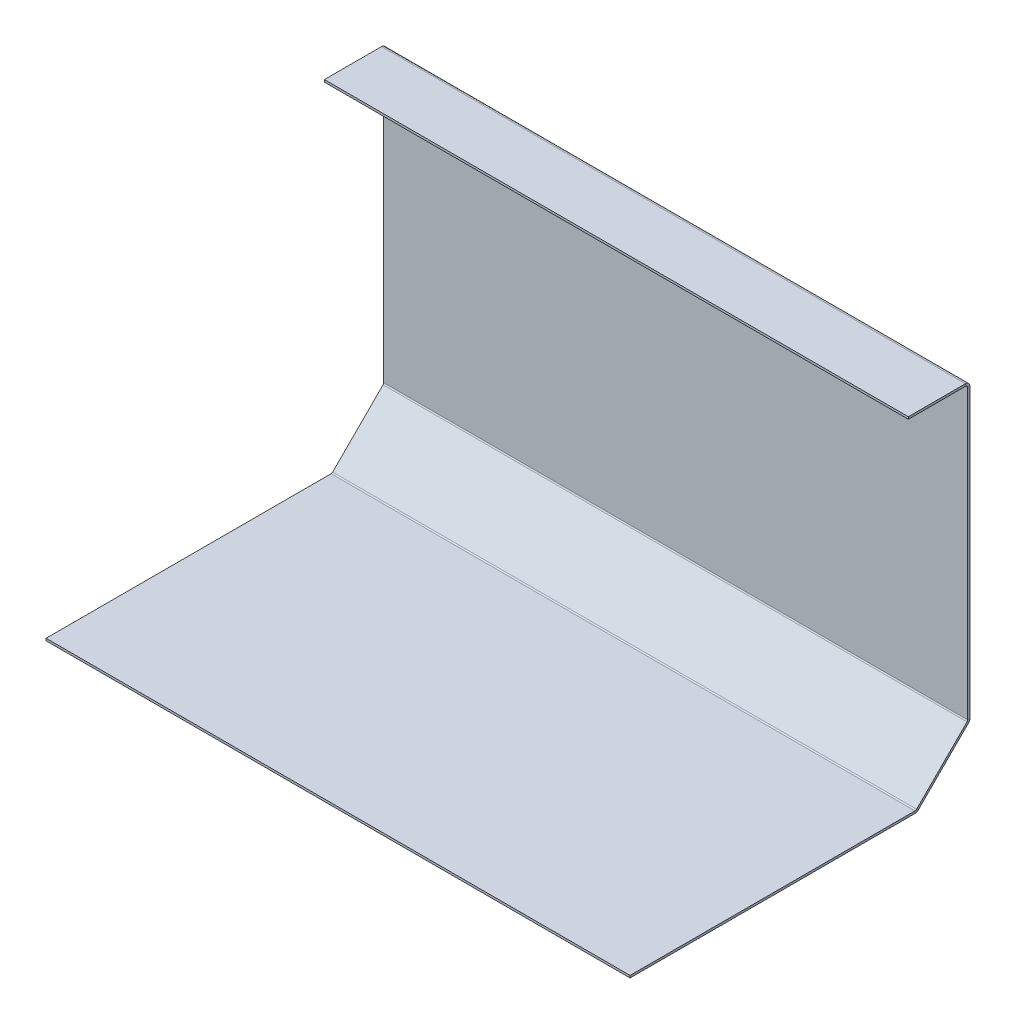
ISO-10303-21;
HEADER;
FILE_DESCRIPTION(('STEP AP214'),'2;1');
FILE_NAME('part.step','',(''),(''),'','','');
FILE_SCHEMA(('AUTOMOTIVE_DESIGN { 1 0 10303 214 1 1 1 1 }'));
ENDSEC;
DATA;
#1=APPLICATION_CONTEXT('core data for automotive mechanical design processes');
#2=APPLICATION_PROTOCOL_DEFINITION('international standard','automotive_design',2000,#1);
#3=PRODUCT_CONTEXT('',#1,'mechanical');
#4=PRODUCT('Part','Part','',(#3));
#5=PRODUCT_RELATED_PRODUCT_CATEGORY('part','',(#4));
#6=PRODUCT_DEFINITION_FORMATION('','',#4);
#7=PRODUCT_DEFINITION_CONTEXT('part definition',#1,'design');
#8=PRODUCT_DEFINITION('design','',#6,#7);
#9=PRODUCT_DEFINITION_SHAPE('','',#8);
#10=(LENGTH_UNIT() NAMED_UNIT(*) SI_UNIT(.MILLI.,.METRE.));
#11=(NAMED_UNIT(*) PLANE_ANGLE_UNIT() SI_UNIT($,.RADIAN.));
#12=(NAMED_UNIT(*) SI_UNIT($,.STERADIAN.) SOLID_ANGLE_UNIT());
#13=UNCERTAINTY_MEASURE_WITH_UNIT(LENGTH_MEASURE(1.E-05),#10,'distance_accuracy_value','');
#14=(GEOMETRIC_REPRESENTATION_CONTEXT(3) GLOBAL_UNCERTAINTY_ASSIGNED_CONTEXT((#13)) GLOBAL_UNIT_ASSIGNED_CONTEXT((#10,
#11,#12)) REPRESENTATION_CONTEXT('',''));
#15=CARTESIAN_POINT('',(0.,0.,0.));
#16=DIRECTION('',(0.,0.,1.));
#17=DIRECTION('',(1.,0.,0.));
#18=AXIS2_PLACEMENT_3D('',#15,#16,#17);
#19=CARTESIAN_POINT('',(192.,0.215745144977995,16.784254855022));
#20=DIRECTION('',(1.,0.,0.));
#21=DIRECTION('',(0.,0.,-1.));
#22=AXIS2_PLACEMENT_3D('',#19,#20,#21);
#23=PLANE('',#22);
#24=DIRECTION('',(0.,-0.70710678118655,-0.707106781186545));
#25=VECTOR('',#24,1.);
#26=CARTESIAN_POINT('',(192.,0.215745144977995,16.784254855022));
#27=LINE('',#26,#25);
#28=CARTESIAN_POINT('',(192.,0.215745144977995,16.784254855022));
#29=VERTEX_POINT('',#28);
#30=CARTESIAN_POINT('',(192.,-0.305109710044021,16.2634));
#31=VERTEX_POINT('',#30);
#32=EDGE_CURVE('E11',#29,#31,#27,.T.);
#33=ORIENTED_EDGE('',*,*,#32,.F.);
#34=CARTESIAN_POINT('',(192.,0.7366,17.305109710044));
#35=DIRECTION('',(-1.,0.,0.));
#36=DIRECTION('',(0.,0.,1.));
#37=AXIS2_PLACEMENT_3D('',#34,#35,#36);
#38=CIRCLE('',#37,0.7366);
#39=CARTESIAN_POINT('',(192.,0.,17.305109710044));
#40=VERTEX_POINT('',#39);
#41=EDGE_CURVE('E310',#40,#29,#38,.F.);
#42=ORIENTED_EDGE('',*,*,#41,.F.);
#43=DIRECTION('',(0.,1.,0.));
#44=VECTOR('',#43,1.);
#45=CARTESIAN_POINT('',(192.,-0.7366,17.305109710044));
#46=LINE('',#45,#44);
#47=CARTESIAN_POINT('',(192.,-0.7366,17.305109710044));
#48=VERTEX_POINT('',#47);
#49=EDGE_CURVE('E45',#48,#40,#46,.T.);
#50=ORIENTED_EDGE('',*,*,#49,.F.);
#51=CARTESIAN_POINT('',(192.,0.7366,17.305109710044));
#52=DIRECTION('',(1.,0.,0.));
#53=DIRECTION('',(0.,0.,-1.));
#54=AXIS2_PLACEMENT_3D('',#51,#52,#53);
#55=CIRCLE('',#54,1.4732);
#56=EDGE_CURVE('E323',#48,#31,#55,.T.);
#57=ORIENTED_EDGE('',*,*,#56,.T.);
#58=EDGE_LOOP('',(#33,#42,#50,#57));
#59=FACE_BOUND('',#58,.T.);
#60=ADVANCED_FACE('F37',(#59),#23,.T.);
#61=CARTESIAN_POINT('',(192.,-0.7366,17.305109710044));
#62=DIRECTION('',(1.,0.,0.));
#63=DIRECTION('',(0.,0.,-1.));
#64=AXIS2_PLACEMENT_3D('',#61,#62,#63);
#65=PLANE('',#64);
#66=DIRECTION('',(0.,0.707106781186547,-0.707106781186548));
#67=VECTOR('',#66,1.);
#68=CARTESIAN_POINT('',(192.,17.,0.));
#69=LINE('',#68,#67);
#70=CARTESIAN_POINT('',(192.,16.784254855022,0.21574514497799));
#71=VERTEX_POINT('',#70);
#72=EDGE_CURVE('E314',#29,#71,#69,.T.);
#73=ORIENTED_EDGE('',*,*,#72,.F.);
#74=ORIENTED_EDGE('',*,*,#32,.T.);
#75=DIRECTION('',(0.,0.707106781186547,-0.707106781186548));
#76=VECTOR('',#75,1.);
#77=CARTESIAN_POINT('',(192.,16.479145144978,-0.520854855022019));
#78=LINE('',#77,#76);
#79=CARTESIAN_POINT('',(192.,16.2634,-0.305109710044023));
#80=VERTEX_POINT('',#79);
#81=EDGE_CURVE('E180',#31,#80,#78,.T.);
#82=ORIENTED_EDGE('',*,*,#81,.T.);
#83=DIRECTION('',(0.,0.70710678118655,0.707106781186545));
#84=VECTOR('',#83,1.);
#85=CARTESIAN_POINT('',(192.,16.2634,-0.305109710044023));
#86=LINE('',#85,#84);
#87=EDGE_CURVE('E171',#80,#71,#86,.T.);
#88=ORIENTED_EDGE('',*,*,#87,.T.);
#89=EDGE_LOOP('',(#73,#74,#82,#88));
#90=FACE_BOUND('',#89,.T.);
#91=ADVANCED_FACE('F328',(#90),#65,.T.);
#92=CARTESIAN_POINT('',(0.,0.,17.305109710044));
#93=DIRECTION('',(-1.,0.,0.));
#94=DIRECTION('',(0.,0.,1.));
#95=AXIS2_PLACEMENT_3D('',#92,#93,#94);
#96=PLANE('',#95);
#97=DIRECTION('',(0.,-1.,0.));
#98=VECTOR('',#97,1.);
#99=CARTESIAN_POINT('',(0.,0.,17.305109710044));
#100=LINE('',#99,#98);
#101=CARTESIAN_POINT('',(0.,0.,17.305109710044));
#102=VERTEX_POINT('',#101);
#103=CARTESIAN_POINT('',(0.,-0.7366,17.305109710044));
#104=VERTEX_POINT('',#103);
#105=EDGE_CURVE('E290',#102,#104,#100,.T.);
#106=ORIENTED_EDGE('',*,*,#105,.F.);
#107=CARTESIAN_POINT('',(0.,0.7366,17.305109710044));
#108=DIRECTION('',(-1.,0.,0.));
#109=DIRECTION('',(0.,0.,1.));
#110=AXIS2_PLACEMENT_3D('',#107,#108,#109);
#111=CIRCLE('',#110,0.7366);
#112=CARTESIAN_POINT('',(0.,0.215745144977995,16.784254855022));
#113=VERTEX_POINT('',#112);
#114=EDGE_CURVE('E220',#102,#113,#111,.F.);
#115=ORIENTED_EDGE('',*,*,#114,.T.);
#116=DIRECTION('',(0.,0.70710678118655,0.707106781186545));
#117=VECTOR('',#116,1.);
#118=CARTESIAN_POINT('',(0.,-0.305109710044021,16.2634));
#119=LINE('',#118,#117);
#120=CARTESIAN_POINT('',(0.,-0.305109710044021,16.2634));
#121=VERTEX_POINT('',#120);
#122=EDGE_CURVE('E170',#121,#113,#119,.T.);
#123=ORIENTED_EDGE('',*,*,#122,.F.);
#124=CARTESIAN_POINT('',(0.,0.7366,17.305109710044));
#125=DIRECTION('',(1.,0.,0.));
#126=DIRECTION('',(0.,0.,-1.));
#127=AXIS2_PLACEMENT_3D('',#124,#125,#126);
#128=CIRCLE('',#127,1.4732);
#129=EDGE_CURVE('E232',#104,#121,#128,.T.);
#130=ORIENTED_EDGE('',*,*,#129,.F.);
#131=EDGE_LOOP('',(#106,#115,#123,#130));
#132=FACE_BOUND('',#131,.T.);
#133=ADVANCED_FACE('F380',(#132),#96,.T.);
#134=CARTESIAN_POINT('',(0.,-0.305109710044021,16.2634));
#135=DIRECTION('',(-1.,0.,0.));
#136=DIRECTION('',(0.,0.,1.));
#137=AXIS2_PLACEMENT_3D('',#134,#135,#136);
#138=PLANE('',#137);
#139=DIRECTION('',(0.,0.,-1.));
#140=VECTOR('',#139,1.);
#141=CARTESIAN_POINT('',(0.,0.,17.));
#142=LINE('',#141,#140);
#143=CARTESIAN_POINT('',(0.,0.,111.));
#144=VERTEX_POINT('',#143);
#145=EDGE_CURVE('E223',#144,#102,#142,.T.);
#146=ORIENTED_EDGE('',*,*,#145,.T.);
#147=ORIENTED_EDGE('',*,*,#105,.T.);
#148=DIRECTION('',(0.,0.,-1.));
#149=VECTOR('',#148,1.);
#150=CARTESIAN_POINT('',(0.,-0.7366,17.));
#151=LINE('',#150,#149);
#152=CARTESIAN_POINT('',(0.,-0.736600000000011,111.));
#153=VERTEX_POINT('',#152);
#154=EDGE_CURVE('E229',#153,#104,#151,.T.);
#155=ORIENTED_EDGE('',*,*,#154,.F.);
#156=DIRECTION('',(0.,1.,0.));
#157=VECTOR('',#156,1.);
#158=CARTESIAN_POINT('',(0.,-0.736600000000011,111.));
#159=LINE('',#158,#157);
#160=EDGE_CURVE('E226',#153,#144,#159,.T.);
#161=ORIENTED_EDGE('',*,*,#160,.T.);
#162=EDGE_LOOP('',(#146,#147,#155,#161));
#163=FACE_BOUND('',#162,.T.);
#164=ADVANCED_FACE('F384',(#163),#138,.T.);
#165=CARTESIAN_POINT('',(192.,17.3051097100441,0.));
#166=DIRECTION('',(1.,0.,0.));
#167=DIRECTION('',(0.,0.,-1.));
#168=AXIS2_PLACEMENT_3D('',#165,#166,#167);
#169=PLANE('',#168);
#170=DIRECTION('',(0.,0.,-1.));
#171=VECTOR('',#170,1.);
#172=CARTESIAN_POINT('',(192.,17.3051097100441,0.));
#173=LINE('',#172,#171);
#174=CARTESIAN_POINT('',(192.,17.3051097100441,0.));
#175=VERTEX_POINT('',#174);
#176=CARTESIAN_POINT('',(192.,17.3051097100441,-0.736600000000008));
#177=VERTEX_POINT('',#176);
#178=EDGE_CURVE('E158',#175,#177,#173,.T.);
#179=ORIENTED_EDGE('',*,*,#178,.F.);
#180=CARTESIAN_POINT('',(192.,17.305109710044,0.736599999999996));
#181=DIRECTION('',(-1.,0.,0.));
#182=DIRECTION('',(0.,0.,1.));
#183=AXIS2_PLACEMENT_3D('',#180,#181,#182);
#184=CIRCLE('',#183,0.7366);
#185=EDGE_CURVE('E340',#71,#175,#184,.F.);
#186=ORIENTED_EDGE('',*,*,#185,.F.);
#187=ORIENTED_EDGE('',*,*,#87,.F.);
#188=CARTESIAN_POINT('',(192.,17.305109710044,0.736599999999996));
#189=DIRECTION('',(1.,0.,0.));
#190=DIRECTION('',(0.,0.,-1.));
#191=AXIS2_PLACEMENT_3D('',#188,#189,#190);
#192=CIRCLE('',#191,1.4732);
#193=EDGE_CURVE('E174',#80,#177,#192,.T.);
#194=ORIENTED_EDGE('',*,*,#193,.T.);
#195=EDGE_LOOP('',(#179,#186,#187,#194));
#196=FACE_BOUND('',#195,.T.);
#197=ADVANCED_FACE('F176',(#196),#169,.T.);
#198=CARTESIAN_POINT('',(192.,16.2634,-0.305109710044023));
#199=DIRECTION('',(1.,0.,0.));
#200=DIRECTION('',(0.,0.,-1.));
#201=AXIS2_PLACEMENT_3D('',#198,#199,#200);
#202=PLANE('',#201);
#203=DIRECTION('',(0.,1.,0.));
#204=VECTOR('',#203,1.);
#205=CARTESIAN_POINT('',(192.,112.6,0.));
#206=LINE('',#205,#204);
#207=CARTESIAN_POINT('',(192.,111.8634,0.));
#208=VERTEX_POINT('',#207);
#209=EDGE_CURVE('E165',#175,#208,#206,.T.);
#210=ORIENTED_EDGE('',*,*,#209,.F.);
#211=ORIENTED_EDGE('',*,*,#178,.T.);
#212=DIRECTION('',(0.,1.,0.));
#213=VECTOR('',#212,1.);
#214=CARTESIAN_POINT('',(192.,112.6,-0.736599999999996));
#215=LINE('',#214,#213);
#216=CARTESIAN_POINT('',(192.,111.8634,-0.736599999999996));
#217=VERTEX_POINT('',#216);
#218=EDGE_CURVE('E162',#177,#217,#215,.T.);
#219=ORIENTED_EDGE('',*,*,#218,.T.);
#220=DIRECTION('',(0.,0.,1.));
#221=VECTOR('',#220,1.);
#222=CARTESIAN_POINT('',(192.,111.8634,-0.736599999999996));
#223=LINE('',#222,#221);
#224=EDGE_CURVE('E281',#217,#208,#223,.T.);
#225=ORIENTED_EDGE('',*,*,#224,.T.);
#226=EDGE_LOOP('',(#210,#211,#219,#225));
#227=FACE_BOUND('',#226,.T.);
#228=ADVANCED_FACE('F160',(#227),#202,.T.);
#229=CARTESIAN_POINT('',(0.,16.784254855022,0.21574514497799));
#230=DIRECTION('',(-1.,0.,0.));
#231=DIRECTION('',(0.,0.,1.));
#232=AXIS2_PLACEMENT_3D('',#229,#230,#231);
#233=PLANE('',#232);
#234=DIRECTION('',(0.,-0.70710678118655,-0.707106781186545));
#235=VECTOR('',#234,1.);
#236=CARTESIAN_POINT('',(0.,16.784254855022,0.21574514497799));
#237=LINE('',#236,#235);
#238=CARTESIAN_POINT('',(0.,16.784254855022,0.21574514497799));
#239=VERTEX_POINT('',#238);
#240=CARTESIAN_POINT('',(0.,16.2634,-0.305109710044023));
#241=VERTEX_POINT('',#240);
#242=EDGE_CURVE('E286',#239,#241,#237,.T.);
#243=ORIENTED_EDGE('',*,*,#242,.F.);
#244=CARTESIAN_POINT('',(0.,17.305109710044,0.736599999999996));
#245=DIRECTION('',(-1.,0.,0.));
#246=DIRECTION('',(0.,0.,1.));
#247=AXIS2_PLACEMENT_3D('',#244,#245,#246);
#248=CIRCLE('',#247,0.7366);
#249=CARTESIAN_POINT('',(0.,17.3051097100441,0.));
#250=VERTEX_POINT('',#249);
#251=EDGE_CURVE('E214',#239,#250,#248,.F.);
#252=ORIENTED_EDGE('',*,*,#251,.T.);
#253=DIRECTION('',(0.,0.,1.));
#254=VECTOR('',#253,1.);
#255=CARTESIAN_POINT('',(0.,17.3051097100441,-0.736600000000008));
#256=LINE('',#255,#254);
#257=CARTESIAN_POINT('',(0.,17.3051097100441,-0.736600000000008));
#258=VERTEX_POINT('',#257);
#259=EDGE_CURVE('E284',#258,#250,#256,.T.);
#260=ORIENTED_EDGE('',*,*,#259,.F.);
#261=CARTESIAN_POINT('',(0.,17.305109710044,0.736599999999996));
#262=DIRECTION('',(1.,0.,0.));
#263=DIRECTION('',(0.,0.,-1.));
#264=AXIS2_PLACEMENT_3D('',#261,#262,#263);
#265=CIRCLE('',#264,1.4732);
#266=EDGE_CURVE('E187',#241,#258,#265,.T.);
#267=ORIENTED_EDGE('',*,*,#266,.F.);
#268=EDGE_LOOP('',(#243,#252,#260,#267));
#269=FACE_BOUND('',#268,.T.);
#270=ADVANCED_FACE('F334',(#269),#233,.T.);
#271=CARTESIAN_POINT('',(0.,17.3051097100441,-0.736600000000008));
#272=DIRECTION('',(-1.,0.,0.));
#273=DIRECTION('',(0.,0.,1.));
#274=AXIS2_PLACEMENT_3D('',#271,#272,#273);
#275=PLANE('',#274);
#276=DIRECTION('',(0.,0.707106781186547,-0.707106781186548));
#277=VECTOR('',#276,1.);
#278=CARTESIAN_POINT('',(0.,17.,0.));
#279=LINE('',#278,#277);
#280=EDGE_CURVE('E217',#113,#239,#279,.T.);
#281=ORIENTED_EDGE('',*,*,#280,.T.);
#282=ORIENTED_EDGE('',*,*,#242,.T.);
#283=DIRECTION('',(0.,0.707106781186547,-0.707106781186548));
#284=VECTOR('',#283,1.);
#285=CARTESIAN_POINT('',(0.,16.479145144978,-0.520854855022019));
#286=LINE('',#285,#284);
#287=EDGE_CURVE('E235',#121,#241,#286,.T.);
#288=ORIENTED_EDGE('',*,*,#287,.F.);
#289=ORIENTED_EDGE('',*,*,#122,.T.);
#290=EDGE_LOOP('',(#281,#282,#288,#289));
#291=FACE_BOUND('',#290,.T.);
#292=ADVANCED_FACE('F392',(#291),#275,.T.);
#293=CARTESIAN_POINT('',(192.,112.6,0.736600000000004));
#294=DIRECTION('',(1.,0.,0.));
#295=DIRECTION('',(0.,0.,-1.));
#296=AXIS2_PLACEMENT_3D('',#293,#294,#295);
#297=PLANE('',#296);
#298=DIRECTION('',(0.,1.,0.));
#299=VECTOR('',#298,1.);
#300=CARTESIAN_POINT('',(192.,112.6,0.736600000000004));
#301=LINE('',#300,#299);
#302=CARTESIAN_POINT('',(192.,112.6,0.736600000000004));
#303=VERTEX_POINT('',#302);
#304=CARTESIAN_POINT('',(192.,113.3366,0.736600000000004));
#305=VERTEX_POINT('',#304);
#306=EDGE_CURVE('E53',#303,#305,#301,.T.);
#307=ORIENTED_EDGE('',*,*,#306,.F.);
#308=CARTESIAN_POINT('',(192.,111.8634,0.736600000000004));
#309=DIRECTION('',(-1.,0.,0.));
#310=DIRECTION('',(0.,0.,1.));
#311=AXIS2_PLACEMENT_3D('',#308,#309,#310);
#312=CIRCLE('',#311,0.7366);
#313=EDGE_CURVE('E368',#208,#303,#312,.F.);
#314=ORIENTED_EDGE('',*,*,#313,.F.);
#315=ORIENTED_EDGE('',*,*,#224,.F.);
#316=CARTESIAN_POINT('',(192.,111.8634,0.736600000000004));
#317=DIRECTION('',(1.,0.,0.));
#318=DIRECTION('',(0.,0.,-1.));
#319=AXIS2_PLACEMENT_3D('',#316,#317,#318);
#320=CIRCLE('',#319,1.4732);
#321=EDGE_CURVE('E195',#217,#305,#320,.T.);
#322=ORIENTED_EDGE('',*,*,#321,.T.);
#323=EDGE_LOOP('',(#307,#314,#315,#322));
#324=FACE_BOUND('',#323,.T.);
#325=ADVANCED_FACE('F394',(#324),#297,.T.);
#326=CARTESIAN_POINT('',(192.,111.8634,-0.736599999999996));
#327=DIRECTION('',(1.,0.,0.));
#328=DIRECTION('',(0.,0.,-1.));
#329=AXIS2_PLACEMENT_3D('',#326,#327,#328);
#330=PLANE('',#329);
#331=DIRECTION('',(0.,0.,1.));
#332=VECTOR('',#331,1.);
#333=CARTESIAN_POINT('',(192.,112.6,0.));
#334=LINE('',#333,#332);
#335=CARTESIAN_POINT('',(192.,112.6,19.5));
#336=VERTEX_POINT('',#335);
#337=EDGE_CURVE('E366',#303,#336,#334,.T.);
#338=ORIENTED_EDGE('',*,*,#337,.F.);
#339=ORIENTED_EDGE('',*,*,#306,.T.);
#340=DIRECTION('',(0.,0.,-1.));
#341=VECTOR('',#340,1.);
#342=CARTESIAN_POINT('',(192.,113.3366,0.));
#343=LINE('',#342,#341);
#344=CARTESIAN_POINT('',(192.,113.3366,19.5));
#345=VERTEX_POINT('',#344);
#346=EDGE_CURVE('E119',#305,#345,#343,.F.);
#347=ORIENTED_EDGE('',*,*,#346,.T.);
#348=DIRECTION('',(0.,1.,0.));
#349=VECTOR('',#348,1.);
#350=CARTESIAN_POINT('',(192.,112.6,19.5));
#351=LINE('',#350,#349);
#352=EDGE_CURVE('E364',#336,#345,#351,.T.);
#353=ORIENTED_EDGE('',*,*,#352,.F.);
#354=EDGE_LOOP('',(#338,#339,#347,#353));
#355=FACE_BOUND('',#354,.T.);
#356=ADVANCED_FACE('F400',(#355),#330,.T.);
#357=CARTESIAN_POINT('',(0.,111.8634,0.));
#358=DIRECTION('',(-1.,0.,0.));
#359=DIRECTION('',(0.,0.,1.));
#360=AXIS2_PLACEMENT_3D('',#357,#358,#359);
#361=PLANE('',#360);
#362=DIRECTION('',(0.,0.,-1.));
#363=VECTOR('',#362,1.);
#364=CARTESIAN_POINT('',(0.,111.8634,0.));
#365=LINE('',#364,#363);
#366=CARTESIAN_POINT('',(0.,111.8634,0.));
#367=VERTEX_POINT('',#366);
#368=CARTESIAN_POINT('',(0.,111.8634,-0.736599999999996));
#369=VERTEX_POINT('',#368);
#370=EDGE_CURVE('E106',#367,#369,#365,.T.);
#371=ORIENTED_EDGE('',*,*,#370,.F.);
#372=CARTESIAN_POINT('',(0.,111.8634,0.736600000000004));
#373=DIRECTION('',(-1.,0.,0.));
#374=DIRECTION('',(0.,0.,1.));
#375=AXIS2_PLACEMENT_3D('',#372,#373,#374);
#376=CIRCLE('',#375,0.7366);
#377=CARTESIAN_POINT('',(0.,112.6,0.736600000000004));
#378=VERTEX_POINT('',#377);
#379=EDGE_CURVE('E210',#367,#378,#376,.F.);
#380=ORIENTED_EDGE('',*,*,#379,.T.);
#381=DIRECTION('',(0.,-1.,0.));
#382=VECTOR('',#381,1.);
#383=CARTESIAN_POINT('',(0.,113.3366,0.736600000000004));
#384=LINE('',#383,#382);
#385=CARTESIAN_POINT('',(0.,113.3366,0.736600000000004));
#386=VERTEX_POINT('',#385);
#387=EDGE_CURVE('E113',#386,#378,#384,.T.);
#388=ORIENTED_EDGE('',*,*,#387,.F.);
#389=CARTESIAN_POINT('',(0.,111.8634,0.736600000000004));
#390=DIRECTION('',(1.,0.,0.));
#391=DIRECTION('',(0.,0.,-1.));
#392=AXIS2_PLACEMENT_3D('',#389,#390,#391);
#393=CIRCLE('',#392,1.4732);
#394=EDGE_CURVE('E241',#369,#386,#393,.T.);
#395=ORIENTED_EDGE('',*,*,#394,.F.);
#396=EDGE_LOOP('',(#371,#380,#388,#395));
#397=FACE_BOUND('',#396,.T.);
#398=ADVANCED_FACE('F351',(#397),#361,.T.);
#399=CARTESIAN_POINT('',(0.,113.3366,0.736600000000004));
#400=DIRECTION('',(-1.,0.,0.));
#401=DIRECTION('',(0.,0.,1.));
#402=AXIS2_PLACEMENT_3D('',#399,#400,#401);
#403=PLANE('',#402);
#404=DIRECTION('',(0.,1.,0.));
#405=VECTOR('',#404,1.);
#406=CARTESIAN_POINT('',(0.,112.6,0.));
#407=LINE('',#406,#405);
#408=EDGE_CURVE('E212',#250,#367,#407,.T.);
#409=ORIENTED_EDGE('',*,*,#408,.T.);
#410=ORIENTED_EDGE('',*,*,#370,.T.);
#411=DIRECTION('',(0.,1.,0.));
#412=VECTOR('',#411,1.);
#413=CARTESIAN_POINT('',(0.,112.6,-0.736599999999996));
#414=LINE('',#413,#412);
#415=EDGE_CURVE('E239',#258,#369,#414,.T.);
#416=ORIENTED_EDGE('',*,*,#415,.F.);
#417=ORIENTED_EDGE('',*,*,#259,.T.);
#418=EDGE_LOOP('',(#409,#410,#416,#417));
#419=FACE_BOUND('',#418,.T.);
#420=ADVANCED_FACE('F336',(#419),#403,.T.);
#421=CARTESIAN_POINT('',(192.,113.3366,0.));
#422=DIRECTION('',(0.,-1.,0.));
#423=DIRECTION('',(0.,0.,-1.));
#424=AXIS2_PLACEMENT_3D('',#421,#422,#423);
#425=PLANE('',#424);
#426=DIRECTION('',(0.,0.,-1.));
#427=VECTOR('',#426,1.);
#428=CARTESIAN_POINT('',(0.,113.3366,0.));
#429=LINE('',#428,#427);
#430=CARTESIAN_POINT('',(0.,113.3366,19.5));
#431=VERTEX_POINT('',#430);
#432=EDGE_CURVE('E201',#386,#431,#429,.F.);
#433=ORIENTED_EDGE('',*,*,#432,.T.);
#434=DIRECTION('',(-1.,0.,0.));
#435=VECTOR('',#434,1.);
#436=CARTESIAN_POINT('',(192.,113.3366,19.5));
#437=LINE('',#436,#435);
#438=EDGE_CURVE('E277',#345,#431,#437,.T.);
#439=ORIENTED_EDGE('',*,*,#438,.F.);
#440=ORIENTED_EDGE('',*,*,#346,.F.);
#441=DIRECTION('',(-1.,0.,0.));
#442=VECTOR('',#441,1.);
#443=CARTESIAN_POINT('',(192.,113.3366,0.736600000000004));
#444=LINE('',#443,#442);
#445=EDGE_CURVE('E197',#305,#386,#444,.T.);
#446=ORIENTED_EDGE('',*,*,#445,.T.);
#447=EDGE_LOOP('',(#433,#439,#440,#446));
#448=FACE_BOUND('',#447,.T.);
#449=ADVANCED_FACE('F357',(#448),#425,.F.);
#450=CARTESIAN_POINT('',(192.,112.6,19.5));
#451=DIRECTION('',(0.,0.,1.));
#452=DIRECTION('',(1.,0.,0.));
#453=AXIS2_PLACEMENT_3D('',#450,#451,#452);
#454=PLANE('',#453);
#455=DIRECTION('',(0.,1.,0.));
#456=VECTOR('',#455,1.);
#457=CARTESIAN_POINT('',(0.,112.6,19.5));
#458=LINE('',#457,#456);
#459=CARTESIAN_POINT('',(0.,112.6,19.5));
#460=VERTEX_POINT('',#459);
#461=EDGE_CURVE('E204',#460,#431,#458,.T.);
#462=ORIENTED_EDGE('',*,*,#461,.F.);
#463=DIRECTION('',(-1.,0.,0.));
#464=VECTOR('',#463,1.);
#465=CARTESIAN_POINT('',(192.,112.6,19.5));
#466=LINE('',#465,#464);
#467=EDGE_CURVE('E275',#336,#460,#466,.T.);
#468=ORIENTED_EDGE('',*,*,#467,.F.);
#469=ORIENTED_EDGE('',*,*,#352,.T.);
#470=ORIENTED_EDGE('',*,*,#438,.T.);
#471=EDGE_LOOP('',(#462,#468,#469,#470));
#472=FACE_BOUND('',#471,.T.);
#473=ADVANCED_FACE('F362',(#472),#454,.T.);
#474=CARTESIAN_POINT('',(192.,112.6,0.));
#475=DIRECTION('',(0.,-1.,0.));
#476=DIRECTION('',(0.,0.,-1.));
#477=AXIS2_PLACEMENT_3D('',#474,#475,#476);
#478=PLANE('',#477);
#479=DIRECTION('',(0.,0.,1.));
#480=VECTOR('',#479,1.);
#481=CARTESIAN_POINT('',(0.,112.6,0.));
#482=LINE('',#481,#480);
#483=EDGE_CURVE('E207',#378,#460,#482,.T.);
#484=ORIENTED_EDGE('',*,*,#483,.F.);
#485=DIRECTION('',(-1.,0.,0.));
#486=VECTOR('',#485,1.);
#487=CARTESIAN_POINT('',(192.,112.6,0.736600000000004));
#488=LINE('',#487,#486);
#489=EDGE_CURVE('E272',#303,#378,#488,.T.);
#490=ORIENTED_EDGE('',*,*,#489,.F.);
#491=ORIENTED_EDGE('',*,*,#337,.T.);
#492=ORIENTED_EDGE('',*,*,#467,.T.);
#493=EDGE_LOOP('',(#484,#490,#491,#492));
#494=FACE_BOUND('',#493,.T.);
#495=ADVANCED_FACE('F484',(#494),#478,.T.);
#496=CARTESIAN_POINT('',(192.,111.8634,0.736600000000004));
#497=DIRECTION('',(-1.,0.,0.));
#498=DIRECTION('',(0.,0.,1.));
#499=AXIS2_PLACEMENT_3D('',#496,#497,#498);
#500=CYLINDRICAL_SURFACE('',#499,0.7366);
#501=ORIENTED_EDGE('',*,*,#379,.F.);
#502=DIRECTION('',(-1.,0.,0.));
#503=VECTOR('',#502,1.);
#504=CARTESIAN_POINT('',(192.,111.8634,0.));
#505=LINE('',#504,#503);
#506=EDGE_CURVE('E269',#208,#367,#505,.T.);
#507=ORIENTED_EDGE('',*,*,#506,.F.);
#508=ORIENTED_EDGE('',*,*,#313,.T.);
#509=ORIENTED_EDGE('',*,*,#489,.T.);
#510=EDGE_LOOP('',(#501,#507,#508,#509));
#511=FACE_BOUND('',#510,.T.);
#512=ADVANCED_FACE('F348',(#511),#500,.F.);
#513=CARTESIAN_POINT('',(192.,112.6,0.));
#514=DIRECTION('',(0.,0.,1.));
#515=DIRECTION('',(0.,-1.,0.));
#516=AXIS2_PLACEMENT_3D('',#513,#514,#515);
#517=PLANE('',#516);
#518=ORIENTED_EDGE('',*,*,#408,.F.);
#519=DIRECTION('',(-1.,0.,0.));
#520=VECTOR('',#519,1.);
#521=CARTESIAN_POINT('',(192.,17.3051097100441,0.));
#522=LINE('',#521,#520);
#523=EDGE_CURVE('E266',#175,#250,#522,.T.);
#524=ORIENTED_EDGE('',*,*,#523,.F.);
#525=ORIENTED_EDGE('',*,*,#209,.T.);
#526=ORIENTED_EDGE('',*,*,#506,.T.);
#527=EDGE_LOOP('',(#518,#524,#525,#526));
#528=FACE_BOUND('',#527,.T.);
#529=ADVANCED_FACE('F342',(#528),#517,.T.);
#530=CARTESIAN_POINT('',(192.,17.305109710044,0.736599999999996));
#531=DIRECTION('',(-1.,0.,0.));
#532=DIRECTION('',(0.,0.,1.));
#533=AXIS2_PLACEMENT_3D('',#530,#531,#532);
#534=CYLINDRICAL_SURFACE('',#533,0.7366);
#535=ORIENTED_EDGE('',*,*,#251,.F.);
#536=DIRECTION('',(-1.,0.,0.));
#537=VECTOR('',#536,1.);
#538=CARTESIAN_POINT('',(192.,16.784254855022,0.21574514497799));
#539=LINE('',#538,#537);
#540=EDGE_CURVE('E263',#71,#239,#539,.T.);
#541=ORIENTED_EDGE('',*,*,#540,.F.);
#542=ORIENTED_EDGE('',*,*,#185,.T.);
#543=ORIENTED_EDGE('',*,*,#523,.T.);
#544=EDGE_LOOP('',(#535,#541,#542,#543));
#545=FACE_BOUND('',#544,.T.);
#546=ADVANCED_FACE('F339',(#545),#534,.F.);
#547=CARTESIAN_POINT('',(192.,17.,0.));
#548=DIRECTION('',(0.,0.707106781186548,0.707106781186547));
#549=DIRECTION('',(0.,-0.707106781186547,0.707106781186548));
#550=AXIS2_PLACEMENT_3D('',#547,#548,#549);
#551=PLANE('',#550);
#552=ORIENTED_EDGE('',*,*,#280,.F.);
#553=DIRECTION('',(-1.,0.,0.));
#554=VECTOR('',#553,1.);
#555=CARTESIAN_POINT('',(192.,0.215745144977995,16.784254855022));
#556=LINE('',#555,#554);
#557=EDGE_CURVE('E260',#29,#113,#556,.T.);
#558=ORIENTED_EDGE('',*,*,#557,.F.);
#559=ORIENTED_EDGE('',*,*,#72,.T.);
#560=ORIENTED_EDGE('',*,*,#540,.T.);
#561=EDGE_LOOP('',(#552,#558,#559,#560));
#562=FACE_BOUND('',#561,.T.);
#563=ADVANCED_FACE('F377',(#562),#551,.T.);
#564=CARTESIAN_POINT('',(192.,0.7366,17.305109710044));
#565=DIRECTION('',(-1.,0.,0.));
#566=DIRECTION('',(0.,0.,1.));
#567=AXIS2_PLACEMENT_3D('',#564,#565,#566);
#568=CYLINDRICAL_SURFACE('',#567,0.7366);
#569=ORIENTED_EDGE('',*,*,#114,.F.);
#570=DIRECTION('',(-1.,0.,0.));
#571=VECTOR('',#570,1.);
#572=CARTESIAN_POINT('',(192.,0.,17.305109710044));
#573=LINE('',#572,#571);
#574=EDGE_CURVE('E257',#40,#102,#573,.T.);
#575=ORIENTED_EDGE('',*,*,#574,.F.);
#576=ORIENTED_EDGE('',*,*,#41,.T.);
#577=ORIENTED_EDGE('',*,*,#557,.T.);
#578=EDGE_LOOP('',(#569,#575,#576,#577));
#579=FACE_BOUND('',#578,.T.);
#580=ADVANCED_FACE('F309',(#579),#568,.F.);
#581=CARTESIAN_POINT('',(192.,0.,17.));
#582=DIRECTION('',(0.,1.,0.));
#583=DIRECTION('',(0.,0.,1.));
#584=AXIS2_PLACEMENT_3D('',#581,#582,#583);
#585=PLANE('',#584);
#586=ORIENTED_EDGE('',*,*,#145,.F.);
#587=DIRECTION('',(-1.,0.,0.));
#588=VECTOR('',#587,1.);
#589=CARTESIAN_POINT('',(192.,0.,111.));
#590=LINE('',#589,#588);
#591=CARTESIAN_POINT('',(192.,0.,111.));
#592=VERTEX_POINT('',#591);
#593=EDGE_CURVE('E255',#592,#144,#590,.T.);
#594=ORIENTED_EDGE('',*,*,#593,.F.);
#595=DIRECTION('',(0.,0.,-1.));
#596=VECTOR('',#595,1.);
#597=CARTESIAN_POINT('',(192.,0.,17.));
#598=LINE('',#597,#596);
#599=EDGE_CURVE('E298',#592,#40,#598,.T.);
#600=ORIENTED_EDGE('',*,*,#599,.T.);
#601=ORIENTED_EDGE('',*,*,#574,.T.);
#602=EDGE_LOOP('',(#586,#594,#600,#601));
#603=FACE_BOUND('',#602,.T.);
#604=ADVANCED_FACE('F316',(#603),#585,.T.);
#605=CARTESIAN_POINT('',(192.,-0.736600000000011,111.));
#606=DIRECTION('',(0.,0.,1.));
#607=DIRECTION('',(1.,0.,0.));
#608=AXIS2_PLACEMENT_3D('',#605,#606,#607);
#609=PLANE('',#608);
#610=ORIENTED_EDGE('',*,*,#160,.F.);
#611=DIRECTION('',(-1.,0.,0.));
#612=VECTOR('',#611,1.);
#613=CARTESIAN_POINT('',(192.,-0.736600000000011,111.));
#614=LINE('',#613,#612);
#615=CARTESIAN_POINT('',(192.,-0.736600000000011,111.));
#616=VERTEX_POINT('',#615);
#617=EDGE_CURVE('E253',#616,#153,#614,.T.);
#618=ORIENTED_EDGE('',*,*,#617,.F.);
#619=DIRECTION('',(0.,1.,0.));
#620=VECTOR('',#619,1.);
#621=CARTESIAN_POINT('',(192.,-0.736600000000011,111.));
#622=LINE('',#621,#620);
#623=EDGE_CURVE('E317',#616,#592,#622,.T.);
#624=ORIENTED_EDGE('',*,*,#623,.T.);
#625=ORIENTED_EDGE('',*,*,#593,.T.);
#626=EDGE_LOOP('',(#610,#618,#624,#625));
#627=FACE_BOUND('',#626,.T.);
#628=ADVANCED_FACE('F549',(#627),#609,.T.);
#629=CARTESIAN_POINT('',(192.,-0.7366,17.));
#630=DIRECTION('',(0.,1.,0.));
#631=DIRECTION('',(0.,0.,1.));
#632=AXIS2_PLACEMENT_3D('',#629,#630,#631);
#633=PLANE('',#632);
#634=ORIENTED_EDGE('',*,*,#154,.T.);
#635=DIRECTION('',(-1.,0.,0.));
#636=VECTOR('',#635,1.);
#637=CARTESIAN_POINT('',(192.,-0.7366,17.305109710044));
#638=LINE('',#637,#636);
#639=EDGE_CURVE('E250',#48,#104,#638,.T.);
#640=ORIENTED_EDGE('',*,*,#639,.F.);
#641=DIRECTION('',(0.,0.,-1.));
#642=VECTOR('',#641,1.);
#643=CARTESIAN_POINT('',(192.,-0.7366,17.));
#644=LINE('',#643,#642);
#645=EDGE_CURVE('E301',#616,#48,#644,.T.);
#646=ORIENTED_EDGE('',*,*,#645,.F.);
#647=ORIENTED_EDGE('',*,*,#617,.T.);
#648=EDGE_LOOP('',(#634,#640,#646,#647));
#649=FACE_BOUND('',#648,.T.);
#650=ADVANCED_FACE('F387',(#649),#633,.F.);
#651=CARTESIAN_POINT('',(192.,0.7366,17.305109710044));
#652=DIRECTION('',(-1.,0.,0.));
#653=DIRECTION('',(0.,0.,1.));
#654=AXIS2_PLACEMENT_3D('',#651,#652,#653);
#655=CYLINDRICAL_SURFACE('',#654,1.4732);
#656=ORIENTED_EDGE('',*,*,#129,.T.);
#657=DIRECTION('',(-1.,0.,0.));
#658=VECTOR('',#657,1.);
#659=CARTESIAN_POINT('',(192.,-0.305109710044021,16.2634));
#660=LINE('',#659,#658);
#661=EDGE_CURVE('E247',#31,#121,#660,.T.);
#662=ORIENTED_EDGE('',*,*,#661,.F.);
#663=ORIENTED_EDGE('',*,*,#56,.F.);
#664=ORIENTED_EDGE('',*,*,#639,.T.);
#665=EDGE_LOOP('',(#656,#662,#663,#664));
#666=FACE_BOUND('',#665,.T.);
#667=ADVANCED_FACE('F390',(#666),#655,.T.);
#668=CARTESIAN_POINT('',(192.,16.479145144978,-0.520854855022019));
#669=DIRECTION('',(0.,0.707106781186548,0.707106781186547));
#670=DIRECTION('',(0.,-0.707106781186547,0.707106781186548));
#671=AXIS2_PLACEMENT_3D('',#668,#669,#670);
#672=PLANE('',#671);
#673=ORIENTED_EDGE('',*,*,#287,.T.);
#674=DIRECTION('',(-1.,0.,0.));
#675=VECTOR('',#674,1.);
#676=CARTESIAN_POINT('',(192.,16.2634,-0.305109710044023));
#677=LINE('',#676,#675);
#678=EDGE_CURVE('E189',#80,#241,#677,.T.);
#679=ORIENTED_EDGE('',*,*,#678,.F.);
#680=ORIENTED_EDGE('',*,*,#81,.F.);
#681=ORIENTED_EDGE('',*,*,#661,.T.);
#682=EDGE_LOOP('',(#673,#679,#680,#681));
#683=FACE_BOUND('',#682,.T.);
#684=ADVANCED_FACE('F331',(#683),#672,.F.);
#685=CARTESIAN_POINT('',(192.,17.305109710044,0.736599999999996));
#686=DIRECTION('',(-1.,0.,0.));
#687=DIRECTION('',(0.,0.,1.));
#688=AXIS2_PLACEMENT_3D('',#685,#686,#687);
#689=CYLINDRICAL_SURFACE('',#688,1.4732);
#690=ORIENTED_EDGE('',*,*,#266,.T.);
#691=DIRECTION('',(-1.,0.,0.));
#692=VECTOR('',#691,1.);
#693=CARTESIAN_POINT('',(192.,17.3051097100441,-0.736600000000008));
#694=LINE('',#693,#692);
#695=EDGE_CURVE('E184',#177,#258,#694,.T.);
#696=ORIENTED_EDGE('',*,*,#695,.F.);
#697=ORIENTED_EDGE('',*,*,#193,.F.);
#698=ORIENTED_EDGE('',*,*,#678,.T.);
#699=EDGE_LOOP('',(#690,#696,#697,#698));
#700=FACE_BOUND('',#699,.T.);
#701=ADVANCED_FACE('F185',(#700),#689,.T.);
#702=CARTESIAN_POINT('',(192.,112.6,-0.736599999999996));
#703=DIRECTION('',(0.,0.,1.));
#704=DIRECTION('',(0.,-1.,0.));
#705=AXIS2_PLACEMENT_3D('',#702,#703,#704);
#706=PLANE('',#705);
#707=ORIENTED_EDGE('',*,*,#415,.T.);
#708=DIRECTION('',(-1.,0.,0.));
#709=VECTOR('',#708,1.);
#710=CARTESIAN_POINT('',(192.,111.8634,-0.736599999999996));
#711=LINE('',#710,#709);
#712=EDGE_CURVE('E190',#217,#369,#711,.T.);
#713=ORIENTED_EDGE('',*,*,#712,.F.);
#714=ORIENTED_EDGE('',*,*,#218,.F.);
#715=ORIENTED_EDGE('',*,*,#695,.T.);
#716=EDGE_LOOP('',(#707,#713,#714,#715));
#717=FACE_BOUND('',#716,.T.);
#718=ADVANCED_FACE('F192',(#717),#706,.F.);
#719=CARTESIAN_POINT('',(192.,111.8634,0.736600000000004));
#720=DIRECTION('',(-1.,0.,0.));
#721=DIRECTION('',(0.,0.,1.));
#722=AXIS2_PLACEMENT_3D('',#719,#720,#721);
#723=CYLINDRICAL_SURFACE('',#722,1.4732);
#724=ORIENTED_EDGE('',*,*,#394,.T.);
#725=ORIENTED_EDGE('',*,*,#445,.F.);
#726=ORIENTED_EDGE('',*,*,#321,.F.);
#727=ORIENTED_EDGE('',*,*,#712,.T.);
#728=EDGE_LOOP('',(#724,#725,#726,#727));
#729=FACE_BOUND('',#728,.T.);
#730=ADVANCED_FACE('F354',(#729),#723,.T.);
#731=CARTESIAN_POINT('',(192.,111.8634,0.736600000000004));
#732=DIRECTION('',(-1.,0.,0.));
#733=DIRECTION('',(0.,0.,1.));
#734=AXIS2_PLACEMENT_3D('',#731,#732,#733);
#735=PLANE('',#734);
#736=ORIENTED_EDGE('',*,*,#645,.T.);
#737=ORIENTED_EDGE('',*,*,#49,.T.);
#738=ORIENTED_EDGE('',*,*,#599,.F.);
#739=ORIENTED_EDGE('',*,*,#623,.F.);
#740=EDGE_LOOP('',(#736,#737,#738,#739));
#741=FACE_BOUND('',#740,.T.);
#742=ADVANCED_FACE('F295',(#741),#735,.F.);
#743=CARTESIAN_POINT('',(0.,111.8634,0.736600000000004));
#744=DIRECTION('',(-1.,0.,0.));
#745=DIRECTION('',(0.,0.,1.));
#746=AXIS2_PLACEMENT_3D('',#743,#744,#745);
#747=PLANE('',#746);
#748=ORIENTED_EDGE('',*,*,#432,.F.);
#749=ORIENTED_EDGE('',*,*,#387,.T.);
#750=ORIENTED_EDGE('',*,*,#483,.T.);
#751=ORIENTED_EDGE('',*,*,#461,.T.);
#752=EDGE_LOOP('',(#748,#749,#750,#751));
#753=FACE_BOUND('',#752,.T.);
#754=ADVANCED_FACE('F359',(#753),#747,.T.);
#755=CLOSED_SHELL('',(#60,#91,#133,#164,#197,#228,#270,#292,#325,#356,#398,#420,#449,#473,#495,
#512,#529,#546,#563,#580,#604,#628,#650,#667,#684,#701,#718,#730,#742,#754));
#756=MANIFOLD_SOLID_BREP('B2',#755);
#757=ADVANCED_BREP_SHAPE_REPRESENTATION('',(#18,#756),#14);
#758=SHAPE_DEFINITION_REPRESENTATION(#9,#757);
ENDSEC;
END-ISO-10303-21;
